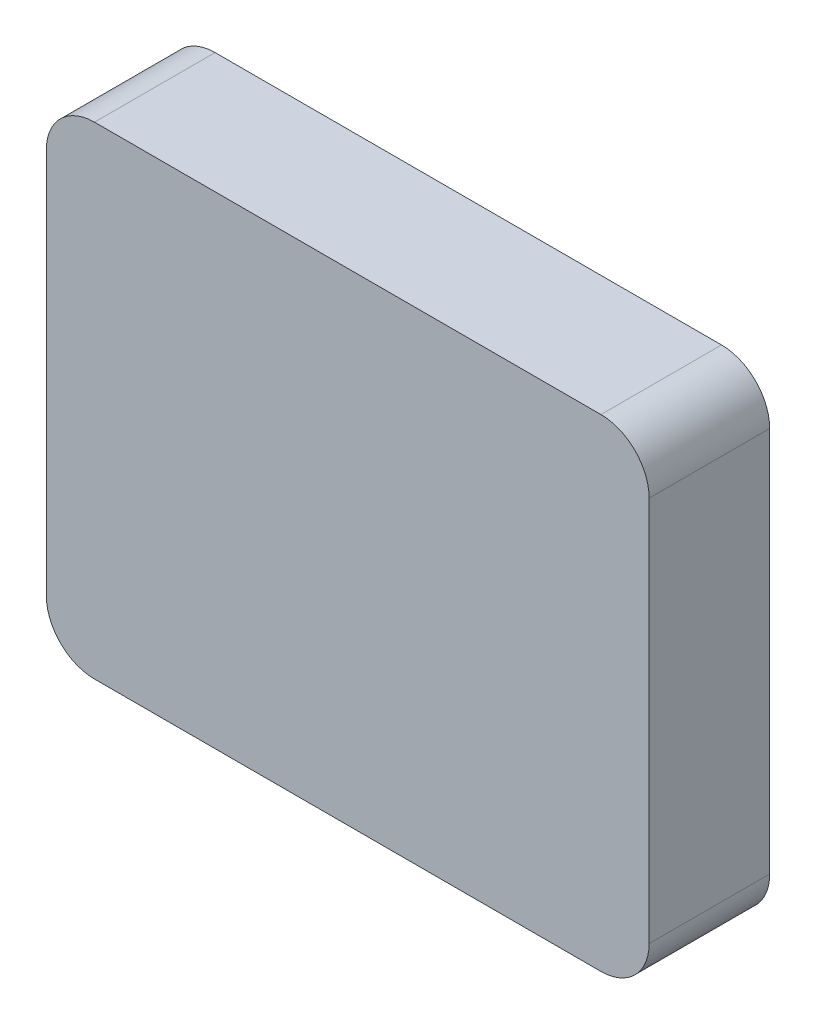
ISO-10303-21;
HEADER;
FILE_DESCRIPTION(('STEP AP214'),'2;1');
FILE_NAME('part.step','',(''),(''),'','','');
FILE_SCHEMA(('AUTOMOTIVE_DESIGN { 1 0 10303 214 1 1 1 1 }'));
ENDSEC;
DATA;
#1=APPLICATION_CONTEXT('core data for automotive mechanical design processes');
#2=APPLICATION_PROTOCOL_DEFINITION('international standard','automotive_design',2000,#1);
#3=PRODUCT_CONTEXT('',#1,'mechanical');
#4=PRODUCT('Part','Part','',(#3));
#5=PRODUCT_RELATED_PRODUCT_CATEGORY('part','',(#4));
#6=PRODUCT_DEFINITION_FORMATION('','',#4);
#7=PRODUCT_DEFINITION_CONTEXT('part definition',#1,'design');
#8=PRODUCT_DEFINITION('design','',#6,#7);
#9=PRODUCT_DEFINITION_SHAPE('','',#8);
#10=(LENGTH_UNIT() NAMED_UNIT(*) SI_UNIT(.MILLI.,.METRE.));
#11=(NAMED_UNIT(*) PLANE_ANGLE_UNIT() SI_UNIT($,.RADIAN.));
#12=(NAMED_UNIT(*) SI_UNIT($,.STERADIAN.) SOLID_ANGLE_UNIT());
#13=UNCERTAINTY_MEASURE_WITH_UNIT(LENGTH_MEASURE(1.E-05),#10,'distance_accuracy_value','');
#14=(GEOMETRIC_REPRESENTATION_CONTEXT(3) GLOBAL_UNCERTAINTY_ASSIGNED_CONTEXT((#13)) GLOBAL_UNIT_ASSIGNED_CONTEXT((#10,
#11,#12)) REPRESENTATION_CONTEXT('',''));
#15=CARTESIAN_POINT('',(0.,0.,0.));
#16=DIRECTION('',(0.,0.,1.));
#17=DIRECTION('',(1.,0.,0.));
#18=AXIS2_PLACEMENT_3D('',#15,#16,#17);
#19=CARTESIAN_POINT('',(125.,100.,25.));
#20=DIRECTION('',(-1.,0.,0.));
#21=DIRECTION('',(0.,-1.,0.));
#22=AXIS2_PLACEMENT_3D('',#19,#20,#21);
#23=PLANE('',#22);
#24=DIRECTION('',(0.,1.,0.));
#25=VECTOR('',#24,1.);
#26=CARTESIAN_POINT('',(125.,100.,-25.));
#27=LINE('',#26,#25);
#28=CARTESIAN_POINT('',(125.,-79.9999999999999,-25.));
#29=VERTEX_POINT('',#28);
#30=CARTESIAN_POINT('',(125.,80.,-25.));
#31=VERTEX_POINT('',#30);
#32=EDGE_CURVE('E136',#29,#31,#27,.T.);
#33=ORIENTED_EDGE('',*,*,#32,.T.);
#34=DIRECTION('',(0.,0.,-1.));
#35=VECTOR('',#34,1.);
#36=CARTESIAN_POINT('',(125.,80.,25.));
#37=LINE('',#36,#35);
#38=CARTESIAN_POINT('',(125.,80.,25.));
#39=VERTEX_POINT('',#38);
#40=EDGE_CURVE('E159',#31,#39,#37,.F.);
#41=ORIENTED_EDGE('',*,*,#40,.T.);
#42=DIRECTION('',(0.,1.,0.));
#43=VECTOR('',#42,1.);
#44=CARTESIAN_POINT('',(125.,100.,25.));
#45=LINE('',#44,#43);
#46=CARTESIAN_POINT('',(125.,-79.9999999999999,25.));
#47=VERTEX_POINT('',#46);
#48=EDGE_CURVE('E134',#47,#39,#45,.T.);
#49=ORIENTED_EDGE('',*,*,#48,.F.);
#50=DIRECTION('',(0.,0.,-1.));
#51=VECTOR('',#50,1.);
#52=CARTESIAN_POINT('',(125.,-80.,25.));
#53=LINE('',#52,#51);
#54=EDGE_CURVE('E156',#47,#29,#53,.T.);
#55=ORIENTED_EDGE('',*,*,#54,.T.);
#56=EDGE_LOOP('',(#33,#41,#49,#55));
#57=FACE_BOUND('',#56,.T.);
#58=ADVANCED_FACE('F41',(#57),#23,.F.);
#59=CARTESIAN_POINT('',(-125.,100.,25.));
#60=DIRECTION('',(0.,-1.,0.));
#61=DIRECTION('',(0.,0.,-1.));
#62=AXIS2_PLACEMENT_3D('',#59,#60,#61);
#63=PLANE('',#62);
#64=DIRECTION('',(-1.,0.,0.));
#65=VECTOR('',#64,1.);
#66=CARTESIAN_POINT('',(-125.,100.,-25.));
#67=LINE('',#66,#65);
#68=CARTESIAN_POINT('',(105.,100.,-25.));
#69=VERTEX_POINT('',#68);
#70=CARTESIAN_POINT('',(-105.,100.,-25.));
#71=VERTEX_POINT('',#70);
#72=EDGE_CURVE('E132',#69,#71,#67,.T.);
#73=ORIENTED_EDGE('',*,*,#72,.T.);
#74=DIRECTION('',(0.,0.,-1.));
#75=VECTOR('',#74,1.);
#76=CARTESIAN_POINT('',(-105.,100.,25.));
#77=LINE('',#76,#75);
#78=CARTESIAN_POINT('',(-105.,100.,25.));
#79=VERTEX_POINT('',#78);
#80=EDGE_CURVE('E111',#71,#79,#77,.F.);
#81=ORIENTED_EDGE('',*,*,#80,.T.);
#82=DIRECTION('',(-1.,0.,0.));
#83=VECTOR('',#82,1.);
#84=CARTESIAN_POINT('',(-125.,100.,25.));
#85=LINE('',#84,#83);
#86=CARTESIAN_POINT('',(105.,100.,25.));
#87=VERTEX_POINT('',#86);
#88=EDGE_CURVE('E175',#87,#79,#85,.T.);
#89=ORIENTED_EDGE('',*,*,#88,.F.);
#90=DIRECTION('',(0.,0.,-1.));
#91=VECTOR('',#90,1.);
#92=CARTESIAN_POINT('',(105.,100.,25.));
#93=LINE('',#92,#91);
#94=EDGE_CURVE('E116',#87,#69,#93,.T.);
#95=ORIENTED_EDGE('',*,*,#94,.T.);
#96=EDGE_LOOP('',(#73,#81,#89,#95));
#97=FACE_BOUND('',#96,.T.);
#98=ADVANCED_FACE('F191',(#97),#63,.F.);
#99=CARTESIAN_POINT('',(-125.,100.,25.));
#100=DIRECTION('',(1.,0.,0.));
#101=DIRECTION('',(0.,1.,0.));
#102=AXIS2_PLACEMENT_3D('',#99,#100,#101);
#103=PLANE('',#102);
#104=DIRECTION('',(0.,-1.,0.));
#105=VECTOR('',#104,1.);
#106=CARTESIAN_POINT('',(-125.,100.,25.));
#107=LINE('',#106,#105);
#108=CARTESIAN_POINT('',(-125.,80.,25.));
#109=VERTEX_POINT('',#108);
#110=CARTESIAN_POINT('',(-125.,-79.9999999999999,25.));
#111=VERTEX_POINT('',#110);
#112=EDGE_CURVE('E125',#109,#111,#107,.T.);
#113=ORIENTED_EDGE('',*,*,#112,.F.);
#114=DIRECTION('',(0.,0.,-1.));
#115=VECTOR('',#114,1.);
#116=CARTESIAN_POINT('',(-125.,80.,25.));
#117=LINE('',#116,#115);
#118=CARTESIAN_POINT('',(-125.,80.,-25.));
#119=VERTEX_POINT('',#118);
#120=EDGE_CURVE('E110',#109,#119,#117,.T.);
#121=ORIENTED_EDGE('',*,*,#120,.T.);
#122=DIRECTION('',(0.,-1.,0.));
#123=VECTOR('',#122,1.);
#124=CARTESIAN_POINT('',(-125.,100.,-25.));
#125=LINE('',#124,#123);
#126=CARTESIAN_POINT('',(-125.,-79.9999999999999,-25.));
#127=VERTEX_POINT('',#126);
#128=EDGE_CURVE('E123',#119,#127,#125,.T.);
#129=ORIENTED_EDGE('',*,*,#128,.T.);
#130=DIRECTION('',(0.,0.,-1.));
#131=VECTOR('',#130,1.);
#132=CARTESIAN_POINT('',(-125.,-80.,25.));
#133=LINE('',#132,#131);
#134=EDGE_CURVE('E127',#127,#111,#133,.F.);
#135=ORIENTED_EDGE('',*,*,#134,.T.);
#136=EDGE_LOOP('',(#113,#121,#129,#135));
#137=FACE_BOUND('',#136,.T.);
#138=ADVANCED_FACE('F122',(#137),#103,.F.);
#139=CARTESIAN_POINT('',(-125.,-100.,25.));
#140=DIRECTION('',(0.,1.,0.));
#141=DIRECTION('',(0.,0.,1.));
#142=AXIS2_PLACEMENT_3D('',#139,#140,#141);
#143=PLANE('',#142);
#144=DIRECTION('',(1.,0.,0.));
#145=VECTOR('',#144,1.);
#146=CARTESIAN_POINT('',(-125.,-100.,-25.));
#147=LINE('',#146,#145);
#148=CARTESIAN_POINT('',(-105.,-100.,-25.));
#149=VERTEX_POINT('',#148);
#150=CARTESIAN_POINT('',(105.,-100.,-25.));
#151=VERTEX_POINT('',#150);
#152=EDGE_CURVE('E131',#149,#151,#147,.T.);
#153=ORIENTED_EDGE('',*,*,#152,.T.);
#154=DIRECTION('',(0.,0.,-1.));
#155=VECTOR('',#154,1.);
#156=CARTESIAN_POINT('',(105.,-100.,25.));
#157=LINE('',#156,#155);
#158=CARTESIAN_POINT('',(105.,-100.,25.));
#159=VERTEX_POINT('',#158);
#160=EDGE_CURVE('E11',#151,#159,#157,.F.);
#161=ORIENTED_EDGE('',*,*,#160,.T.);
#162=DIRECTION('',(1.,0.,0.));
#163=VECTOR('',#162,1.);
#164=CARTESIAN_POINT('',(-125.,-100.,25.));
#165=LINE('',#164,#163);
#166=CARTESIAN_POINT('',(-105.,-100.,25.));
#167=VERTEX_POINT('',#166);
#168=EDGE_CURVE('E140',#167,#159,#165,.T.);
#169=ORIENTED_EDGE('',*,*,#168,.F.);
#170=DIRECTION('',(0.,0.,-1.));
#171=VECTOR('',#170,1.);
#172=CARTESIAN_POINT('',(-105.,-100.,25.));
#173=LINE('',#172,#171);
#174=EDGE_CURVE('E49',#167,#149,#173,.T.);
#175=ORIENTED_EDGE('',*,*,#174,.T.);
#176=EDGE_LOOP('',(#153,#161,#169,#175));
#177=FACE_BOUND('',#176,.T.);
#178=ADVANCED_FACE('F162',(#177),#143,.F.);
#179=CARTESIAN_POINT('',(0.,0.,25.));
#180=DIRECTION('',(0.,0.,1.));
#181=DIRECTION('',(1.,0.,0.));
#182=AXIS2_PLACEMENT_3D('',#179,#180,#181);
#183=PLANE('',#182);
#184=ORIENTED_EDGE('',*,*,#88,.T.);
#185=CARTESIAN_POINT('',(-105.,80.,25.));
#186=DIRECTION('',(0.,0.,1.));
#187=DIRECTION('',(1.,0.,0.));
#188=AXIS2_PLACEMENT_3D('',#185,#186,#187);
#189=CIRCLE('',#188,20.);
#190=EDGE_CURVE('E154',#79,#109,#189,.T.);
#191=ORIENTED_EDGE('',*,*,#190,.T.);
#192=ORIENTED_EDGE('',*,*,#112,.T.);
#193=CARTESIAN_POINT('',(-105.,-80.,25.));
#194=DIRECTION('',(0.,0.,1.));
#195=DIRECTION('',(1.,0.,0.));
#196=AXIS2_PLACEMENT_3D('',#193,#194,#195);
#197=CIRCLE('',#196,20.);
#198=EDGE_CURVE('E61',#111,#167,#197,.T.);
#199=ORIENTED_EDGE('',*,*,#198,.T.);
#200=ORIENTED_EDGE('',*,*,#168,.T.);
#201=CARTESIAN_POINT('',(105.,-80.,25.));
#202=DIRECTION('',(0.,0.,1.));
#203=DIRECTION('',(1.,0.,0.));
#204=AXIS2_PLACEMENT_3D('',#201,#202,#203);
#205=CIRCLE('',#204,20.);
#206=EDGE_CURVE('E150',#159,#47,#205,.T.);
#207=ORIENTED_EDGE('',*,*,#206,.T.);
#208=ORIENTED_EDGE('',*,*,#48,.T.);
#209=CARTESIAN_POINT('',(105.,80.,25.));
#210=DIRECTION('',(0.,0.,1.));
#211=DIRECTION('',(1.,0.,0.));
#212=AXIS2_PLACEMENT_3D('',#209,#210,#211);
#213=CIRCLE('',#212,20.);
#214=EDGE_CURVE('E152',#39,#87,#213,.T.);
#215=ORIENTED_EDGE('',*,*,#214,.T.);
#216=EDGE_LOOP('',(#184,#191,#192,#199,#200,#207,#208,#215));
#217=FACE_BOUND('',#216,.T.);
#218=ADVANCED_FACE('F181',(#217),#183,.T.);
#219=CARTESIAN_POINT('',(0.,0.,-25.));
#220=DIRECTION('',(0.,0.,1.));
#221=DIRECTION('',(1.,0.,0.));
#222=AXIS2_PLACEMENT_3D('',#219,#220,#221);
#223=PLANE('',#222);
#224=ORIENTED_EDGE('',*,*,#128,.F.);
#225=CARTESIAN_POINT('',(-105.,80.,-25.));
#226=DIRECTION('',(0.,0.,1.));
#227=DIRECTION('',(1.,0.,0.));
#228=AXIS2_PLACEMENT_3D('',#225,#226,#227);
#229=CIRCLE('',#228,20.);
#230=EDGE_CURVE('E106',#119,#71,#229,.F.);
#231=ORIENTED_EDGE('',*,*,#230,.T.);
#232=ORIENTED_EDGE('',*,*,#72,.F.);
#233=CARTESIAN_POINT('',(105.,80.,-25.));
#234=DIRECTION('',(0.,0.,1.));
#235=DIRECTION('',(1.,0.,0.));
#236=AXIS2_PLACEMENT_3D('',#233,#234,#235);
#237=CIRCLE('',#236,20.);
#238=EDGE_CURVE('E117',#69,#31,#237,.F.);
#239=ORIENTED_EDGE('',*,*,#238,.T.);
#240=ORIENTED_EDGE('',*,*,#32,.F.);
#241=CARTESIAN_POINT('',(105.,-80.,-25.));
#242=DIRECTION('',(0.,0.,1.));
#243=DIRECTION('',(1.,0.,0.));
#244=AXIS2_PLACEMENT_3D('',#241,#242,#243);
#245=CIRCLE('',#244,20.);
#246=EDGE_CURVE('E143',#29,#151,#245,.F.);
#247=ORIENTED_EDGE('',*,*,#246,.T.);
#248=ORIENTED_EDGE('',*,*,#152,.F.);
#249=CARTESIAN_POINT('',(-105.,-80.,-25.));
#250=DIRECTION('',(0.,0.,1.));
#251=DIRECTION('',(1.,0.,0.));
#252=AXIS2_PLACEMENT_3D('',#249,#250,#251);
#253=CIRCLE('',#252,20.);
#254=EDGE_CURVE('E126',#149,#127,#253,.F.);
#255=ORIENTED_EDGE('',*,*,#254,.T.);
#256=EDGE_LOOP('',(#224,#231,#232,#239,#240,#247,#248,#255));
#257=FACE_BOUND('',#256,.T.);
#258=ADVANCED_FACE('F129',(#257),#223,.F.);
#259=CARTESIAN_POINT('',(-105.,80.,25.));
#260=DIRECTION('',(0.,0.,-1.));
#261=DIRECTION('',(-1.,0.,0.));
#262=AXIS2_PLACEMENT_3D('',#259,#260,#261);
#263=CYLINDRICAL_SURFACE('',#262,20.);
#264=ORIENTED_EDGE('',*,*,#190,.F.);
#265=ORIENTED_EDGE('',*,*,#80,.F.);
#266=ORIENTED_EDGE('',*,*,#230,.F.);
#267=ORIENTED_EDGE('',*,*,#120,.F.);
#268=EDGE_LOOP('',(#264,#265,#266,#267));
#269=FACE_BOUND('',#268,.T.);
#270=ADVANCED_FACE('F109',(#269),#263,.T.);
#271=CARTESIAN_POINT('',(105.,80.,25.));
#272=DIRECTION('',(0.,0.,-1.));
#273=DIRECTION('',(-1.,0.,0.));
#274=AXIS2_PLACEMENT_3D('',#271,#272,#273);
#275=CYLINDRICAL_SURFACE('',#274,20.);
#276=ORIENTED_EDGE('',*,*,#214,.F.);
#277=ORIENTED_EDGE('',*,*,#40,.F.);
#278=ORIENTED_EDGE('',*,*,#238,.F.);
#279=ORIENTED_EDGE('',*,*,#94,.F.);
#280=EDGE_LOOP('',(#276,#277,#278,#279));
#281=FACE_BOUND('',#280,.T.);
#282=ADVANCED_FACE('F201',(#281),#275,.T.);
#283=CARTESIAN_POINT('',(105.,-80.,25.));
#284=DIRECTION('',(0.,0.,-1.));
#285=DIRECTION('',(-1.,0.,0.));
#286=AXIS2_PLACEMENT_3D('',#283,#284,#285);
#287=CYLINDRICAL_SURFACE('',#286,20.);
#288=ORIENTED_EDGE('',*,*,#206,.F.);
#289=ORIENTED_EDGE('',*,*,#160,.F.);
#290=ORIENTED_EDGE('',*,*,#246,.F.);
#291=ORIENTED_EDGE('',*,*,#54,.F.);
#292=EDGE_LOOP('',(#288,#289,#290,#291));
#293=FACE_BOUND('',#292,.T.);
#294=ADVANCED_FACE('F169',(#293),#287,.T.);
#295=CARTESIAN_POINT('',(-105.,-80.,25.));
#296=DIRECTION('',(0.,0.,-1.));
#297=DIRECTION('',(-1.,0.,0.));
#298=AXIS2_PLACEMENT_3D('',#295,#296,#297);
#299=CYLINDRICAL_SURFACE('',#298,20.);
#300=ORIENTED_EDGE('',*,*,#198,.F.);
#301=ORIENTED_EDGE('',*,*,#134,.F.);
#302=ORIENTED_EDGE('',*,*,#254,.F.);
#303=ORIENTED_EDGE('',*,*,#174,.F.);
#304=EDGE_LOOP('',(#300,#301,#302,#303));
#305=FACE_BOUND('',#304,.T.);
#306=ADVANCED_FACE('F43',(#305),#299,.T.);
#307=CLOSED_SHELL('',(#58,#98,#138,#178,#218,#258,#270,#282,#294,#306));
#308=MANIFOLD_SOLID_BREP('B2',#307);
#309=ADVANCED_BREP_SHAPE_REPRESENTATION('',(#18,#308),#14);
#310=SHAPE_DEFINITION_REPRESENTATION(#9,#309);
ENDSEC;
END-ISO-10303-21;
